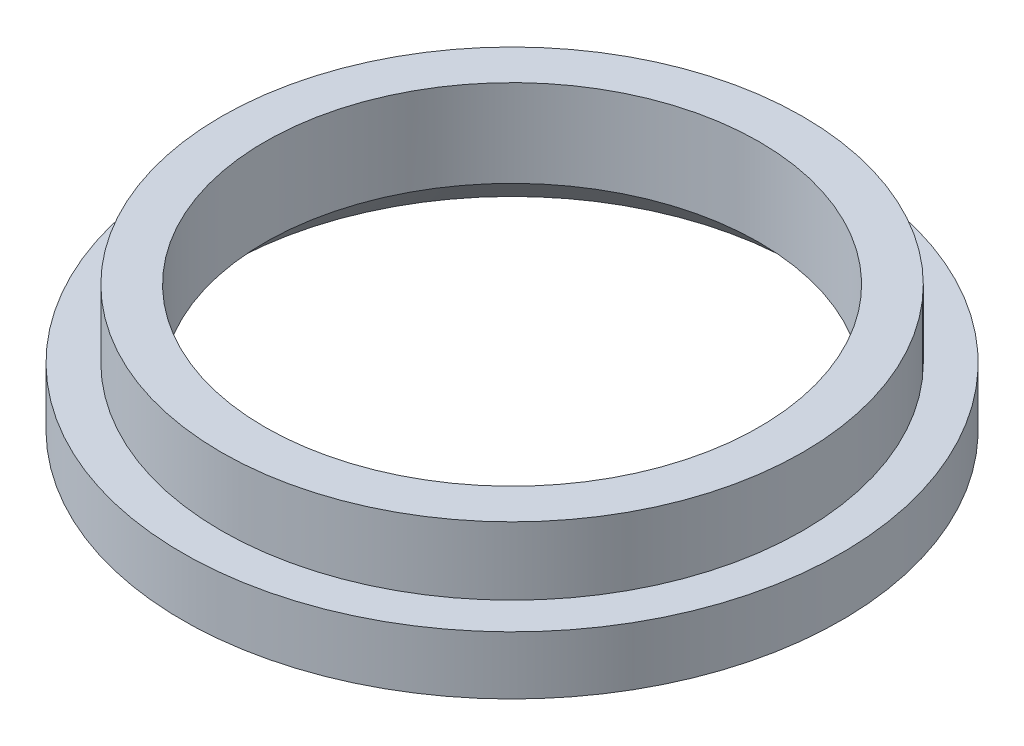
ISO-10303-21;
HEADER;
FILE_DESCRIPTION(('STEP AP214'),'2;1');
FILE_NAME('part.step','',(''),(''),'','','');
FILE_SCHEMA(('AUTOMOTIVE_DESIGN { 1 0 10303 214 1 1 1 1 }'));
ENDSEC;
DATA;
#1=APPLICATION_CONTEXT('core data for automotive mechanical design processes');
#2=APPLICATION_PROTOCOL_DEFINITION('international standard','automotive_design',2000,#1);
#3=PRODUCT_CONTEXT('',#1,'mechanical');
#4=PRODUCT('Part','Part','',(#3));
#5=PRODUCT_RELATED_PRODUCT_CATEGORY('part','',(#4));
#6=PRODUCT_DEFINITION_FORMATION('','',#4);
#7=PRODUCT_DEFINITION_CONTEXT('part definition',#1,'design');
#8=PRODUCT_DEFINITION('design','',#6,#7);
#9=PRODUCT_DEFINITION_SHAPE('','',#8);
#10=(LENGTH_UNIT() NAMED_UNIT(*) SI_UNIT(.MILLI.,.METRE.));
#11=(NAMED_UNIT(*) PLANE_ANGLE_UNIT() SI_UNIT($,.RADIAN.));
#12=(NAMED_UNIT(*) SI_UNIT($,.STERADIAN.) SOLID_ANGLE_UNIT());
#13=UNCERTAINTY_MEASURE_WITH_UNIT(LENGTH_MEASURE(1.E-05),#10,'distance_accuracy_value','');
#14=(GEOMETRIC_REPRESENTATION_CONTEXT(3) GLOBAL_UNCERTAINTY_ASSIGNED_CONTEXT((#13)) GLOBAL_UNIT_ASSIGNED_CONTEXT((#10,
#11,#12)) REPRESENTATION_CONTEXT('',''));
#15=CARTESIAN_POINT('',(0.,0.,0.));
#16=DIRECTION('',(0.,0.,1.));
#17=DIRECTION('',(1.,0.,0.));
#18=AXIS2_PLACEMENT_3D('',#15,#16,#17);
#19=CARTESIAN_POINT('',(0.,3.5,0.));
#20=DIRECTION('',(0.,1.,0.));
#21=DIRECTION('',(0.,0.,1.));
#22=AXIS2_PLACEMENT_3D('',#19,#20,#21);
#23=PLANE('',#22);
#24=CARTESIAN_POINT('',(0.,3.5,0.));
#25=DIRECTION('',(0.,1.,0.));
#26=DIRECTION('',(0.,0.,1.));
#27=AXIS2_PLACEMENT_3D('',#24,#25,#26);
#28=CIRCLE('',#27,15.);
#29=CARTESIAN_POINT('',(0.,3.5,15.));
#30=VERTEX_POINT('',#29);
#31=EDGE_CURVE('E55',#30,#30,#28,.T.);
#32=ORIENTED_EDGE('',*,*,#31,.T.);
#33=EDGE_LOOP('',(#32));
#34=FACE_BOUND('',#33,.T.);
#35=CARTESIAN_POINT('',(0.,3.5,0.));
#36=DIRECTION('',(0.,1.,0.));
#37=DIRECTION('',(0.,0.,1.));
#38=AXIS2_PLACEMENT_3D('',#35,#36,#37);
#39=CIRCLE('',#38,12.75);
#40=CARTESIAN_POINT('',(0.,3.5,12.75));
#41=VERTEX_POINT('',#40);
#42=EDGE_CURVE('E59',#41,#41,#39,.T.);
#43=ORIENTED_EDGE('',*,*,#42,.F.);
#44=EDGE_LOOP('',(#43));
#45=FACE_BOUND('',#44,.T.);
#46=ADVANCED_FACE('F43',(#34,#45),#23,.T.);
#47=CARTESIAN_POINT('',(0.,3.5,0.));
#48=DIRECTION('',(0.,-1.,0.));
#49=DIRECTION('',(0.,0.,-1.));
#50=AXIS2_PLACEMENT_3D('',#47,#48,#49);
#51=CYLINDRICAL_SURFACE('',#50,15.);
#52=ORIENTED_EDGE('',*,*,#31,.F.);
#53=EDGE_LOOP('',(#52));
#54=FACE_BOUND('',#53,.T.);
#55=CARTESIAN_POINT('',(0.,0.,0.));
#56=DIRECTION('',(0.,1.,0.));
#57=DIRECTION('',(0.,0.,1.));
#58=AXIS2_PLACEMENT_3D('',#55,#56,#57);
#59=CIRCLE('',#58,15.);
#60=CARTESIAN_POINT('',(0.,0.,15.));
#61=VERTEX_POINT('',#60);
#62=EDGE_CURVE('E62',#61,#61,#59,.T.);
#63=ORIENTED_EDGE('',*,*,#62,.T.);
#64=EDGE_LOOP('',(#63));
#65=FACE_BOUND('',#64,.T.);
#66=ADVANCED_FACE('F93',(#54,#65),#51,.T.);
#67=CARTESIAN_POINT('',(0.,3.5,0.));
#68=DIRECTION('',(0.,-1.,0.));
#69=DIRECTION('',(0.,0.,-1.));
#70=AXIS2_PLACEMENT_3D('',#67,#68,#69);
#71=CYLINDRICAL_SURFACE('',#70,12.75);
#72=CARTESIAN_POINT('',(0.,-1.00000000000001,0.));
#73=DIRECTION('',(0.,-1.,0.));
#74=DIRECTION('',(0.,0.,-1.));
#75=AXIS2_PLACEMENT_3D('',#72,#73,#74);
#76=CIRCLE('',#75,12.75);
#77=CARTESIAN_POINT('',(0.,-1.00000000000001,-12.75));
#78=VERTEX_POINT('',#77);
#79=EDGE_CURVE('E51',#78,#78,#76,.T.);
#80=ORIENTED_EDGE('',*,*,#79,.T.);
#81=EDGE_LOOP('',(#80));
#82=FACE_BOUND('',#81,.T.);
#83=ORIENTED_EDGE('',*,*,#42,.T.);
#84=EDGE_LOOP('',(#83));
#85=FACE_BOUND('',#84,.T.);
#86=ADVANCED_FACE('F89',(#82,#85),#71,.F.);
#87=CARTESIAN_POINT('',(0.,-3.,0.));
#88=DIRECTION('',(0.,-1.,0.));
#89=DIRECTION('',(0.,0.,-1.));
#90=AXIS2_PLACEMENT_3D('',#87,#88,#89);
#91=PLANE('',#90);
#92=CARTESIAN_POINT('',(0.,-3.,0.));
#93=DIRECTION('',(0.,-1.,0.));
#94=DIRECTION('',(0.,0.,-1.));
#95=AXIS2_PLACEMENT_3D('',#92,#93,#94);
#96=CIRCLE('',#95,14.75);
#97=CARTESIAN_POINT('',(0.,-3.,-14.75));
#98=VERTEX_POINT('',#97);
#99=EDGE_CURVE('E10',#98,#98,#96,.F.);
#100=ORIENTED_EDGE('',*,*,#99,.T.);
#101=EDGE_LOOP('',(#100));
#102=FACE_BOUND('',#101,.T.);
#103=CARTESIAN_POINT('',(0.,-3.,0.));
#104=DIRECTION('',(0.,-1.,0.));
#105=DIRECTION('',(0.,0.,-1.));
#106=AXIS2_PLACEMENT_3D('',#103,#104,#105);
#107=CIRCLE('',#106,17.);
#108=CARTESIAN_POINT('',(0.,-3.,-17.));
#109=VERTEX_POINT('',#108);
#110=EDGE_CURVE('E64',#109,#109,#107,.T.);
#111=ORIENTED_EDGE('',*,*,#110,.T.);
#112=EDGE_LOOP('',(#111));
#113=FACE_BOUND('',#112,.T.);
#114=ADVANCED_FACE('F74',(#102,#113),#91,.T.);
#115=CARTESIAN_POINT('',(0.,0.,0.));
#116=DIRECTION('',(0.,-1.,0.));
#117=DIRECTION('',(0.,0.,-1.));
#118=AXIS2_PLACEMENT_3D('',#115,#116,#117);
#119=PLANE('',#118);
#120=ORIENTED_EDGE('',*,*,#62,.F.);
#121=EDGE_LOOP('',(#120));
#122=FACE_BOUND('',#121,.T.);
#123=CARTESIAN_POINT('',(0.,0.,0.));
#124=DIRECTION('',(0.,-1.,0.));
#125=DIRECTION('',(0.,0.,-1.));
#126=AXIS2_PLACEMENT_3D('',#123,#124,#125);
#127=CIRCLE('',#126,17.);
#128=CARTESIAN_POINT('',(0.,0.,-17.));
#129=VERTEX_POINT('',#128);
#130=EDGE_CURVE('E68',#129,#129,#127,.T.);
#131=ORIENTED_EDGE('',*,*,#130,.F.);
#132=EDGE_LOOP('',(#131));
#133=FACE_BOUND('',#132,.T.);
#134=ADVANCED_FACE('F79',(#122,#133),#119,.F.);
#135=CARTESIAN_POINT('',(0.,-3.,0.));
#136=DIRECTION('',(0.,1.,0.));
#137=DIRECTION('',(0.,0.,1.));
#138=AXIS2_PLACEMENT_3D('',#135,#136,#137);
#139=CYLINDRICAL_SURFACE('',#138,17.);
#140=ORIENTED_EDGE('',*,*,#110,.F.);
#141=EDGE_LOOP('',(#140));
#142=FACE_BOUND('',#141,.T.);
#143=ORIENTED_EDGE('',*,*,#130,.T.);
#144=EDGE_LOOP('',(#143));
#145=FACE_BOUND('',#144,.T.);
#146=ADVANCED_FACE('F76',(#142,#145),#139,.T.);
#147=CARTESIAN_POINT('',(0.,-1.00000000000001,0.));
#148=DIRECTION('',(0.,-1.,0.));
#149=DIRECTION('',(0.,0.,-1.));
#150=AXIS2_PLACEMENT_3D('',#147,#148,#149);
#151=CONICAL_SURFACE('',#150,12.75,0.78539816339745);
#152=ORIENTED_EDGE('',*,*,#99,.F.);
#153=EDGE_LOOP('',(#152));
#154=FACE_BOUND('',#153,.T.);
#155=ORIENTED_EDGE('',*,*,#79,.F.);
#156=EDGE_LOOP('',(#155));
#157=FACE_BOUND('',#156,.T.);
#158=ADVANCED_FACE('F46',(#154,#157),#151,.F.);
#159=CLOSED_SHELL('',(#46,#66,#86,#114,#134,#146,#158));
#160=MANIFOLD_SOLID_BREP('B2',#159);
#161=ADVANCED_BREP_SHAPE_REPRESENTATION('',(#18,#160),#14);
#162=SHAPE_DEFINITION_REPRESENTATION(#9,#161);
ENDSEC;
END-ISO-10303-21;
